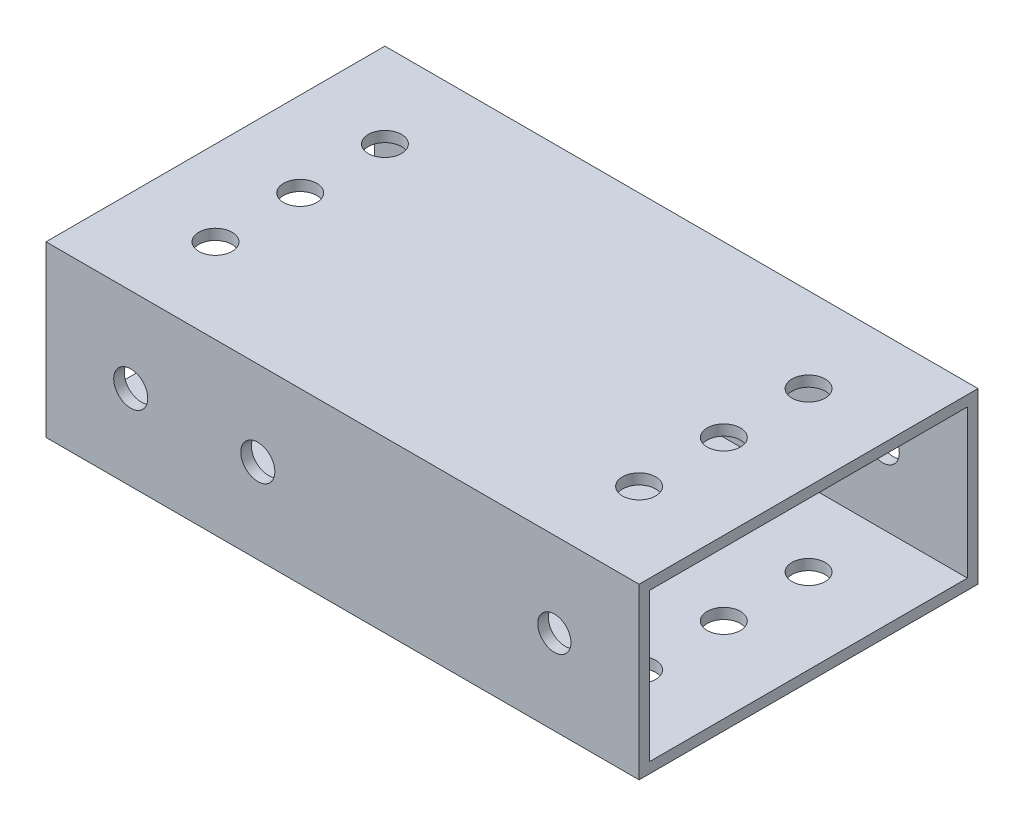
ISO-10303-21;
HEADER;
FILE_DESCRIPTION(('STEP AP214'),'2;1');
FILE_NAME('part.step','',(''),(''),'','','');
FILE_SCHEMA(('AUTOMOTIVE_DESIGN { 1 0 10303 214 1 1 1 1 }'));
ENDSEC;
DATA;
#1=APPLICATION_CONTEXT('core data for automotive mechanical design processes');
#2=APPLICATION_PROTOCOL_DEFINITION('international standard','automotive_design',2000,#1);
#3=PRODUCT_CONTEXT('',#1,'mechanical');
#4=PRODUCT('Part','Part','',(#3));
#5=PRODUCT_RELATED_PRODUCT_CATEGORY('part','',(#4));
#6=PRODUCT_DEFINITION_FORMATION('','',#4);
#7=PRODUCT_DEFINITION_CONTEXT('part definition',#1,'design');
#8=PRODUCT_DEFINITION('design','',#6,#7);
#9=PRODUCT_DEFINITION_SHAPE('','',#8);
#10=(LENGTH_UNIT() NAMED_UNIT(*) SI_UNIT(.MILLI.,.METRE.));
#11=(NAMED_UNIT(*) PLANE_ANGLE_UNIT() SI_UNIT($,.RADIAN.));
#12=(NAMED_UNIT(*) SI_UNIT($,.STERADIAN.) SOLID_ANGLE_UNIT());
#13=UNCERTAINTY_MEASURE_WITH_UNIT(LENGTH_MEASURE(1.E-05),#10,'distance_accuracy_value','');
#14=(GEOMETRIC_REPRESENTATION_CONTEXT(3) GLOBAL_UNCERTAINTY_ASSIGNED_CONTEXT((#13)) GLOBAL_UNIT_ASSIGNED_CONTEXT((#10,
#11,#12)) REPRESENTATION_CONTEXT('',''));
#15=CARTESIAN_POINT('',(0.,0.,0.));
#16=DIRECTION('',(0.,0.,1.));
#17=DIRECTION('',(1.,0.,0.));
#18=AXIS2_PLACEMENT_3D('',#15,#16,#17);
#19=CARTESIAN_POINT('',(44.45,0.,0.));
#20=DIRECTION('',(-1.,0.,0.));
#21=DIRECTION('',(0.,0.,1.));
#22=AXIS2_PLACEMENT_3D('',#19,#20,#21);
#23=PLANE('',#22);
#24=DIRECTION('',(0.,-1.,0.));
#25=VECTOR('',#24,1.);
#26=CARTESIAN_POINT('',(44.45,0.,0.));
#27=LINE('',#26,#25);
#28=CARTESIAN_POINT('',(44.45,25.4,0.));
#29=VERTEX_POINT('',#28);
#30=CARTESIAN_POINT('',(44.45,0.,0.));
#31=VERTEX_POINT('',#30);
#32=EDGE_CURVE('E135',#29,#31,#27,.T.);
#33=ORIENTED_EDGE('',*,*,#32,.T.);
#34=DIRECTION('',(0.,0.,-1.));
#35=VECTOR('',#34,1.);
#36=CARTESIAN_POINT('',(44.45,0.,0.));
#37=LINE('',#36,#35);
#38=CARTESIAN_POINT('',(44.45,0.,-50.8));
#39=VERTEX_POINT('',#38);
#40=EDGE_CURVE('E138',#31,#39,#37,.T.);
#41=ORIENTED_EDGE('',*,*,#40,.T.);
#42=DIRECTION('',(0.,1.,0.));
#43=VECTOR('',#42,1.);
#44=CARTESIAN_POINT('',(44.45,0.,-50.8));
#45=LINE('',#44,#43);
#46=CARTESIAN_POINT('',(44.45,25.4,-50.8));
#47=VERTEX_POINT('',#46);
#48=EDGE_CURVE('E141',#39,#47,#45,.T.);
#49=ORIENTED_EDGE('',*,*,#48,.T.);
#50=DIRECTION('',(0.,0.,1.));
#51=VECTOR('',#50,1.);
#52=CARTESIAN_POINT('',(44.45,25.4,0.));
#53=LINE('',#52,#51);
#54=EDGE_CURVE('E143',#47,#29,#53,.T.);
#55=ORIENTED_EDGE('',*,*,#54,.T.);
#56=EDGE_LOOP('',(#33,#41,#49,#55));
#57=FACE_BOUND('',#56,.T.);
#58=DIRECTION('',(0.,-1.,0.));
#59=VECTOR('',#58,1.);
#60=CARTESIAN_POINT('',(44.45,0.,-1.5875));
#61=LINE('',#60,#59);
#62=CARTESIAN_POINT('',(44.45,23.8125,-1.5875));
#63=VERTEX_POINT('',#62);
#64=CARTESIAN_POINT('',(44.45,1.5875,-1.5875));
#65=VERTEX_POINT('',#64);
#66=EDGE_CURVE('E123',#63,#65,#61,.T.);
#67=ORIENTED_EDGE('',*,*,#66,.F.);
#68=DIRECTION('',(0.,0.,1.));
#69=VECTOR('',#68,1.);
#70=CARTESIAN_POINT('',(44.45,23.8125,0.));
#71=LINE('',#70,#69);
#72=CARTESIAN_POINT('',(44.45,23.8125,-49.2125));
#73=VERTEX_POINT('',#72);
#74=EDGE_CURVE('E107',#73,#63,#71,.T.);
#75=ORIENTED_EDGE('',*,*,#74,.F.);
#76=DIRECTION('',(0.,1.,0.));
#77=VECTOR('',#76,1.);
#78=CARTESIAN_POINT('',(44.45,0.,-49.2125));
#79=LINE('',#78,#77);
#80=CARTESIAN_POINT('',(44.45,1.5875,-49.2125));
#81=VERTEX_POINT('',#80);
#82=EDGE_CURVE('E132',#81,#73,#79,.T.);
#83=ORIENTED_EDGE('',*,*,#82,.F.);
#84=DIRECTION('',(0.,0.,-1.));
#85=VECTOR('',#84,1.);
#86=CARTESIAN_POINT('',(44.45,1.5875,0.));
#87=LINE('',#86,#85);
#88=EDGE_CURVE('E125',#65,#81,#87,.T.);
#89=ORIENTED_EDGE('',*,*,#88,.F.);
#90=EDGE_LOOP('',(#67,#75,#83,#89));
#91=FACE_BOUND('',#90,.T.);
#92=ADVANCED_FACE('F35',(#57,#91),#23,.F.);
#93=CARTESIAN_POINT('',(-44.45,0.,0.));
#94=DIRECTION('',(-1.,0.,0.));
#95=DIRECTION('',(0.,0.,1.));
#96=AXIS2_PLACEMENT_3D('',#93,#94,#95);
#97=PLANE('',#96);
#98=DIRECTION('',(0.,-1.,0.));
#99=VECTOR('',#98,1.);
#100=CARTESIAN_POINT('',(-44.45,0.,0.));
#101=LINE('',#100,#99);
#102=CARTESIAN_POINT('',(-44.45,25.4,0.));
#103=VERTEX_POINT('',#102);
#104=CARTESIAN_POINT('',(-44.45,0.,0.));
#105=VERTEX_POINT('',#104);
#106=EDGE_CURVE('E146',#103,#105,#101,.T.);
#107=ORIENTED_EDGE('',*,*,#106,.F.);
#108=DIRECTION('',(0.,0.,1.));
#109=VECTOR('',#108,1.);
#110=CARTESIAN_POINT('',(-44.45,25.4,0.));
#111=LINE('',#110,#109);
#112=CARTESIAN_POINT('',(-44.45,25.4,-50.8));
#113=VERTEX_POINT('',#112);
#114=EDGE_CURVE('E139',#113,#103,#111,.T.);
#115=ORIENTED_EDGE('',*,*,#114,.F.);
#116=DIRECTION('',(0.,1.,0.));
#117=VECTOR('',#116,1.);
#118=CARTESIAN_POINT('',(-44.45,0.,-50.8));
#119=LINE('',#118,#117);
#120=CARTESIAN_POINT('',(-44.45,0.,-50.8));
#121=VERTEX_POINT('',#120);
#122=EDGE_CURVE('E151',#121,#113,#119,.T.);
#123=ORIENTED_EDGE('',*,*,#122,.F.);
#124=DIRECTION('',(0.,0.,-1.));
#125=VECTOR('',#124,1.);
#126=CARTESIAN_POINT('',(-44.45,0.,0.));
#127=LINE('',#126,#125);
#128=EDGE_CURVE('E149',#105,#121,#127,.T.);
#129=ORIENTED_EDGE('',*,*,#128,.F.);
#130=EDGE_LOOP('',(#107,#115,#123,#129));
#131=FACE_BOUND('',#130,.T.);
#132=DIRECTION('',(0.,0.,1.));
#133=VECTOR('',#132,1.);
#134=CARTESIAN_POINT('',(-44.45,23.8125,0.));
#135=LINE('',#134,#133);
#136=CARTESIAN_POINT('',(-44.45,23.8125,-49.2125));
#137=VERTEX_POINT('',#136);
#138=CARTESIAN_POINT('',(-44.45,23.8125,-1.5875));
#139=VERTEX_POINT('',#138);
#140=EDGE_CURVE('E105',#137,#139,#135,.T.);
#141=ORIENTED_EDGE('',*,*,#140,.T.);
#142=DIRECTION('',(0.,-1.,0.));
#143=VECTOR('',#142,1.);
#144=CARTESIAN_POINT('',(-44.45,0.,-1.5875));
#145=LINE('',#144,#143);
#146=CARTESIAN_POINT('',(-44.45,1.5875,-1.5875));
#147=VERTEX_POINT('',#146);
#148=EDGE_CURVE('E113',#139,#147,#145,.T.);
#149=ORIENTED_EDGE('',*,*,#148,.T.);
#150=DIRECTION('',(0.,0.,-1.));
#151=VECTOR('',#150,1.);
#152=CARTESIAN_POINT('',(-44.45,1.5875,0.));
#153=LINE('',#152,#151);
#154=CARTESIAN_POINT('',(-44.45,1.5875,-49.2125));
#155=VERTEX_POINT('',#154);
#156=EDGE_CURVE('E119',#147,#155,#153,.T.);
#157=ORIENTED_EDGE('',*,*,#156,.T.);
#158=DIRECTION('',(0.,1.,0.));
#159=VECTOR('',#158,1.);
#160=CARTESIAN_POINT('',(-44.45,0.,-49.2125));
#161=LINE('',#160,#159);
#162=EDGE_CURVE('E59',#155,#137,#161,.T.);
#163=ORIENTED_EDGE('',*,*,#162,.T.);
#164=EDGE_LOOP('',(#141,#149,#157,#163));
#165=FACE_BOUND('',#164,.T.);
#166=ADVANCED_FACE('F122',(#131,#165),#97,.T.);
#167=CARTESIAN_POINT('',(44.45,0.,0.));
#168=DIRECTION('',(0.,0.,-1.));
#169=DIRECTION('',(-1.,0.,0.));
#170=AXIS2_PLACEMENT_3D('',#167,#168,#169);
#171=PLANE('',#170);
#172=CARTESIAN_POINT('',(-31.75,12.7,0.));
#173=DIRECTION('',(0.,0.,1.));
#174=DIRECTION('',(1.,0.,0.));
#175=AXIS2_PLACEMENT_3D('',#172,#173,#174);
#176=CIRCLE('',#175,2.5527);
#177=CARTESIAN_POINT('',(-29.1973,12.7,0.));
#178=VERTEX_POINT('',#177);
#179=EDGE_CURVE('E561',#178,#178,#176,.T.);
#180=ORIENTED_EDGE('',*,*,#179,.F.);
#181=EDGE_LOOP('',(#180));
#182=FACE_BOUND('',#181,.T.);
#183=CARTESIAN_POINT('',(-12.7,12.7,0.));
#184=DIRECTION('',(0.,0.,1.));
#185=DIRECTION('',(1.,0.,0.));
#186=AXIS2_PLACEMENT_3D('',#183,#184,#185);
#187=CIRCLE('',#186,2.5527);
#188=CARTESIAN_POINT('',(-10.1473,12.7,0.));
#189=VERTEX_POINT('',#188);
#190=EDGE_CURVE('E562',#189,#189,#187,.T.);
#191=ORIENTED_EDGE('',*,*,#190,.F.);
#192=EDGE_LOOP('',(#191));
#193=FACE_BOUND('',#192,.T.);
#194=CARTESIAN_POINT('',(31.75,12.7,0.));
#195=DIRECTION('',(0.,0.,-1.));
#196=DIRECTION('',(-1.,0.,0.));
#197=AXIS2_PLACEMENT_3D('',#194,#195,#196);
#198=CIRCLE('',#197,2.4892);
#199=CARTESIAN_POINT('',(29.2608,12.7,0.));
#200=VERTEX_POINT('',#199);
#201=EDGE_CURVE('E200',#200,#200,#198,.T.);
#202=ORIENTED_EDGE('',*,*,#201,.T.);
#203=EDGE_LOOP('',(#202));
#204=FACE_BOUND('',#203,.T.);
#205=ORIENTED_EDGE('',*,*,#106,.T.);
#206=DIRECTION('',(-1.,0.,0.));
#207=VECTOR('',#206,1.);
#208=CARTESIAN_POINT('',(44.45,0.,0.));
#209=LINE('',#208,#207);
#210=EDGE_CURVE('E11',#31,#105,#209,.T.);
#211=ORIENTED_EDGE('',*,*,#210,.F.);
#212=ORIENTED_EDGE('',*,*,#32,.F.);
#213=DIRECTION('',(-1.,0.,0.));
#214=VECTOR('',#213,1.);
#215=CARTESIAN_POINT('',(44.45,25.4,0.));
#216=LINE('',#215,#214);
#217=EDGE_CURVE('E145',#29,#103,#216,.T.);
#218=ORIENTED_EDGE('',*,*,#217,.T.);
#219=EDGE_LOOP('',(#205,#211,#212,#218));
#220=FACE_BOUND('',#219,.T.);
#221=ADVANCED_FACE('F37',(#182,#193,#204,#220),#171,.F.);
#222=CARTESIAN_POINT('',(44.45,0.,0.));
#223=DIRECTION('',(0.,1.,0.));
#224=DIRECTION('',(0.,0.,1.));
#225=AXIS2_PLACEMENT_3D('',#222,#223,#224);
#226=PLANE('',#225);
#227=CARTESIAN_POINT('',(31.75,0.,-38.1));
#228=DIRECTION('',(0.,-1.,0.));
#229=DIRECTION('',(0.,0.,1.));
#230=AXIS2_PLACEMENT_3D('',#227,#228,#229);
#231=CIRCLE('',#230,2.4892);
#232=CARTESIAN_POINT('',(31.75,0.,-35.6108));
#233=VERTEX_POINT('',#232);
#234=EDGE_CURVE('E217',#233,#233,#231,.T.);
#235=ORIENTED_EDGE('',*,*,#234,.F.);
#236=EDGE_LOOP('',(#235));
#237=FACE_BOUND('',#236,.T.);
#238=CARTESIAN_POINT('',(31.75,0.,-12.7));
#239=DIRECTION('',(0.,-1.,0.));
#240=DIRECTION('',(0.,0.,1.));
#241=AXIS2_PLACEMENT_3D('',#238,#239,#240);
#242=CIRCLE('',#241,2.4892);
#243=CARTESIAN_POINT('',(31.75,0.,-10.2108));
#244=VERTEX_POINT('',#243);
#245=EDGE_CURVE('E210',#244,#244,#242,.T.);
#246=ORIENTED_EDGE('',*,*,#245,.F.);
#247=EDGE_LOOP('',(#246));
#248=FACE_BOUND('',#247,.T.);
#249=CARTESIAN_POINT('',(31.75,0.,-25.4));
#250=DIRECTION('',(0.,-1.,0.));
#251=DIRECTION('',(0.,0.,1.));
#252=AXIS2_PLACEMENT_3D('',#249,#250,#251);
#253=CIRCLE('',#252,2.4892);
#254=CARTESIAN_POINT('',(31.75,0.,-22.9108));
#255=VERTEX_POINT('',#254);
#256=EDGE_CURVE('E182',#255,#255,#253,.T.);
#257=ORIENTED_EDGE('',*,*,#256,.F.);
#258=EDGE_LOOP('',(#257));
#259=FACE_BOUND('',#258,.T.);
#260=CARTESIAN_POINT('',(-31.75,0.,-38.1));
#261=DIRECTION('',(0.,1.,0.));
#262=DIRECTION('',(0.,0.,1.));
#263=AXIS2_PLACEMENT_3D('',#260,#261,#262);
#264=CIRCLE('',#263,2.4892);
#265=CARTESIAN_POINT('',(-31.75,0.,-35.6108));
#266=VERTEX_POINT('',#265);
#267=EDGE_CURVE('E241',#266,#266,#264,.T.);
#268=ORIENTED_EDGE('',*,*,#267,.T.);
#269=EDGE_LOOP('',(#268));
#270=FACE_BOUND('',#269,.T.);
#271=CARTESIAN_POINT('',(-31.75,0.,-12.7));
#272=DIRECTION('',(0.,1.,0.));
#273=DIRECTION('',(0.,0.,1.));
#274=AXIS2_PLACEMENT_3D('',#271,#272,#273);
#275=CIRCLE('',#274,2.4892);
#276=CARTESIAN_POINT('',(-31.75,0.,-10.2108));
#277=VERTEX_POINT('',#276);
#278=EDGE_CURVE('E234',#277,#277,#275,.T.);
#279=ORIENTED_EDGE('',*,*,#278,.T.);
#280=EDGE_LOOP('',(#279));
#281=FACE_BOUND('',#280,.T.);
#282=CARTESIAN_POINT('',(-31.75,0.,-25.4));
#283=DIRECTION('',(0.,1.,0.));
#284=DIRECTION('',(0.,0.,1.));
#285=AXIS2_PLACEMENT_3D('',#282,#283,#284);
#286=CIRCLE('',#285,2.4892);
#287=CARTESIAN_POINT('',(-31.75,0.,-22.9108));
#288=VERTEX_POINT('',#287);
#289=EDGE_CURVE('E165',#288,#288,#286,.T.);
#290=ORIENTED_EDGE('',*,*,#289,.T.);
#291=EDGE_LOOP('',(#290));
#292=FACE_BOUND('',#291,.T.);
#293=ORIENTED_EDGE('',*,*,#128,.T.);
#294=DIRECTION('',(-1.,0.,0.));
#295=VECTOR('',#294,1.);
#296=CARTESIAN_POINT('',(44.45,0.,-50.8));
#297=LINE('',#296,#295);
#298=EDGE_CURVE('E44',#39,#121,#297,.T.);
#299=ORIENTED_EDGE('',*,*,#298,.F.);
#300=ORIENTED_EDGE('',*,*,#40,.F.);
#301=ORIENTED_EDGE('',*,*,#210,.T.);
#302=EDGE_LOOP('',(#293,#299,#300,#301));
#303=FACE_BOUND('',#302,.T.);
#304=ADVANCED_FACE('F292',(#237,#248,#259,#270,#281,#292,#303),#226,.F.);
#305=CARTESIAN_POINT('',(44.45,0.,-50.8));
#306=DIRECTION('',(0.,0.,1.));
#307=DIRECTION('',(1.,0.,0.));
#308=AXIS2_PLACEMENT_3D('',#305,#306,#307);
#309=PLANE('',#308);
#310=CARTESIAN_POINT('',(-12.7,12.7,-50.8));
#311=DIRECTION('',(0.,0.,1.));
#312=DIRECTION('',(1.,0.,0.));
#313=AXIS2_PLACEMENT_3D('',#310,#311,#312);
#314=CIRCLE('',#313,2.5527);
#315=CARTESIAN_POINT('',(-10.1473,12.7,-50.8));
#316=VERTEX_POINT('',#315);
#317=EDGE_CURVE('E565',#316,#316,#314,.T.);
#318=ORIENTED_EDGE('',*,*,#317,.T.);
#319=EDGE_LOOP('',(#318));
#320=FACE_BOUND('',#319,.T.);
#321=CARTESIAN_POINT('',(31.75,12.7,-50.8));
#322=DIRECTION('',(0.,0.,-1.));
#323=DIRECTION('',(-1.,0.,0.));
#324=AXIS2_PLACEMENT_3D('',#321,#322,#323);
#325=CIRCLE('',#324,2.4892);
#326=CARTESIAN_POINT('',(29.2608,12.7,-50.8));
#327=VERTEX_POINT('',#326);
#328=EDGE_CURVE('E193',#327,#327,#325,.T.);
#329=ORIENTED_EDGE('',*,*,#328,.F.);
#330=EDGE_LOOP('',(#329));
#331=FACE_BOUND('',#330,.T.);
#332=CARTESIAN_POINT('',(-31.75,12.7,-50.8));
#333=DIRECTION('',(0.,0.,1.));
#334=DIRECTION('',(1.,0.,0.));
#335=AXIS2_PLACEMENT_3D('',#332,#333,#334);
#336=CIRCLE('',#335,2.4892);
#337=CARTESIAN_POINT('',(-29.2608,12.7,-50.8));
#338=VERTEX_POINT('',#337);
#339=EDGE_CURVE('E177',#338,#338,#336,.T.);
#340=ORIENTED_EDGE('',*,*,#339,.T.);
#341=EDGE_LOOP('',(#340));
#342=FACE_BOUND('',#341,.T.);
#343=ORIENTED_EDGE('',*,*,#122,.T.);
#344=DIRECTION('',(-1.,0.,0.));
#345=VECTOR('',#344,1.);
#346=CARTESIAN_POINT('',(44.45,25.4,-50.8));
#347=LINE('',#346,#345);
#348=EDGE_CURVE('E156',#47,#113,#347,.T.);
#349=ORIENTED_EDGE('',*,*,#348,.F.);
#350=ORIENTED_EDGE('',*,*,#48,.F.);
#351=ORIENTED_EDGE('',*,*,#298,.T.);
#352=EDGE_LOOP('',(#343,#349,#350,#351));
#353=FACE_BOUND('',#352,.T.);
#354=ADVANCED_FACE('F289',(#320,#331,#342,#353),#309,.F.);
#355=CARTESIAN_POINT('',(44.45,25.4,0.));
#356=DIRECTION('',(0.,-1.,0.));
#357=DIRECTION('',(0.,0.,-1.));
#358=AXIS2_PLACEMENT_3D('',#355,#356,#357);
#359=PLANE('',#358);
#360=CARTESIAN_POINT('',(31.75,25.4,-38.1));
#361=DIRECTION('',(0.,-1.,0.));
#362=DIRECTION('',(0.,0.,1.));
#363=AXIS2_PLACEMENT_3D('',#360,#361,#362);
#364=CIRCLE('',#363,2.4892);
#365=CARTESIAN_POINT('',(31.75,25.4,-35.6108));
#366=VERTEX_POINT('',#365);
#367=EDGE_CURVE('E197',#366,#366,#364,.T.);
#368=ORIENTED_EDGE('',*,*,#367,.T.);
#369=EDGE_LOOP('',(#368));
#370=FACE_BOUND('',#369,.T.);
#371=CARTESIAN_POINT('',(31.75,25.4,-12.7));
#372=DIRECTION('',(0.,-1.,0.));
#373=DIRECTION('',(0.,0.,1.));
#374=AXIS2_PLACEMENT_3D('',#371,#372,#373);
#375=CIRCLE('',#374,2.4892);
#376=CARTESIAN_POINT('',(31.75,25.4,-10.2108));
#377=VERTEX_POINT('',#376);
#378=EDGE_CURVE('E214',#377,#377,#375,.T.);
#379=ORIENTED_EDGE('',*,*,#378,.T.);
#380=EDGE_LOOP('',(#379));
#381=FACE_BOUND('',#380,.T.);
#382=CARTESIAN_POINT('',(31.75,25.4,-25.4));
#383=DIRECTION('',(0.,-1.,0.));
#384=DIRECTION('',(0.,0.,1.));
#385=AXIS2_PLACEMENT_3D('',#382,#383,#384);
#386=CIRCLE('',#385,2.4892);
#387=CARTESIAN_POINT('',(31.75,25.4,-22.9108));
#388=VERTEX_POINT('',#387);
#389=EDGE_CURVE('E213',#388,#388,#386,.T.);
#390=ORIENTED_EDGE('',*,*,#389,.T.);
#391=EDGE_LOOP('',(#390));
#392=FACE_BOUND('',#391,.T.);
#393=CARTESIAN_POINT('',(-31.75,25.4,-38.1));
#394=DIRECTION('',(0.,1.,0.));
#395=DIRECTION('',(0.,0.,1.));
#396=AXIS2_PLACEMENT_3D('',#393,#394,#395);
#397=CIRCLE('',#396,2.4892);
#398=CARTESIAN_POINT('',(-31.75,25.4,-35.6108));
#399=VERTEX_POINT('',#398);
#400=EDGE_CURVE('E176',#399,#399,#397,.T.);
#401=ORIENTED_EDGE('',*,*,#400,.F.);
#402=EDGE_LOOP('',(#401));
#403=FACE_BOUND('',#402,.T.);
#404=CARTESIAN_POINT('',(-31.75,25.4,-12.7));
#405=DIRECTION('',(0.,1.,0.));
#406=DIRECTION('',(0.,0.,1.));
#407=AXIS2_PLACEMENT_3D('',#404,#405,#406);
#408=CIRCLE('',#407,2.4892);
#409=CARTESIAN_POINT('',(-31.75,25.4,-10.2108));
#410=VERTEX_POINT('',#409);
#411=EDGE_CURVE('E238',#410,#410,#408,.T.);
#412=ORIENTED_EDGE('',*,*,#411,.F.);
#413=EDGE_LOOP('',(#412));
#414=FACE_BOUND('',#413,.T.);
#415=CARTESIAN_POINT('',(-31.75,25.4,-25.4));
#416=DIRECTION('',(0.,1.,0.));
#417=DIRECTION('',(0.,0.,1.));
#418=AXIS2_PLACEMENT_3D('',#415,#416,#417);
#419=CIRCLE('',#418,2.4892);
#420=CARTESIAN_POINT('',(-31.75,25.4,-22.9108));
#421=VERTEX_POINT('',#420);
#422=EDGE_CURVE('E237',#421,#421,#419,.T.);
#423=ORIENTED_EDGE('',*,*,#422,.F.);
#424=EDGE_LOOP('',(#423));
#425=FACE_BOUND('',#424,.T.);
#426=ORIENTED_EDGE('',*,*,#114,.T.);
#427=ORIENTED_EDGE('',*,*,#217,.F.);
#428=ORIENTED_EDGE('',*,*,#54,.F.);
#429=ORIENTED_EDGE('',*,*,#348,.T.);
#430=EDGE_LOOP('',(#426,#427,#428,#429));
#431=FACE_BOUND('',#430,.T.);
#432=ADVANCED_FACE('F273',(#370,#381,#392,#403,#414,#425,#431),#359,.F.);
#433=CARTESIAN_POINT('',(44.45,0.,-1.5875));
#434=DIRECTION('',(0.,0.,-1.));
#435=DIRECTION('',(-1.,0.,0.));
#436=AXIS2_PLACEMENT_3D('',#433,#434,#435);
#437=PLANE('',#436);
#438=CARTESIAN_POINT('',(-31.75,12.7,-1.5875));
#439=DIRECTION('',(0.,0.,-1.));
#440=DIRECTION('',(-1.,0.,0.));
#441=AXIS2_PLACEMENT_3D('',#438,#439,#440);
#442=CIRCLE('',#441,2.5527);
#443=CARTESIAN_POINT('',(-34.3027,12.7,-1.5875));
#444=VERTEX_POINT('',#443);
#445=EDGE_CURVE('E558',#444,#444,#442,.F.);
#446=ORIENTED_EDGE('',*,*,#445,.T.);
#447=EDGE_LOOP('',(#446));
#448=FACE_BOUND('',#447,.T.);
#449=CARTESIAN_POINT('',(-12.7,12.7,-1.5875));
#450=DIRECTION('',(0.,0.,-1.));
#451=DIRECTION('',(-1.,0.,0.));
#452=AXIS2_PLACEMENT_3D('',#449,#450,#451);
#453=CIRCLE('',#452,2.5527);
#454=CARTESIAN_POINT('',(-15.2527,12.7,-1.5875));
#455=VERTEX_POINT('',#454);
#456=EDGE_CURVE('E205',#455,#455,#453,.T.);
#457=ORIENTED_EDGE('',*,*,#456,.F.);
#458=EDGE_LOOP('',(#457));
#459=FACE_BOUND('',#458,.T.);
#460=CARTESIAN_POINT('',(31.75,12.7,-1.5875));
#461=DIRECTION('',(0.,0.,-1.));
#462=DIRECTION('',(-1.,0.,0.));
#463=AXIS2_PLACEMENT_3D('',#460,#461,#462);
#464=CIRCLE('',#463,2.4892);
#465=CARTESIAN_POINT('',(29.2608,12.7,-1.5875));
#466=VERTEX_POINT('',#465);
#467=EDGE_CURVE('E192',#466,#466,#464,.F.);
#468=ORIENTED_EDGE('',*,*,#467,.T.);
#469=EDGE_LOOP('',(#468));
#470=FACE_BOUND('',#469,.T.);
#471=ORIENTED_EDGE('',*,*,#148,.F.);
#472=DIRECTION('',(-1.,0.,0.));
#473=VECTOR('',#472,1.);
#474=CARTESIAN_POINT('',(44.45,23.8125,-1.5875));
#475=LINE('',#474,#473);
#476=EDGE_CURVE('E101',#63,#139,#475,.T.);
#477=ORIENTED_EDGE('',*,*,#476,.F.);
#478=ORIENTED_EDGE('',*,*,#66,.T.);
#479=DIRECTION('',(-1.,0.,0.));
#480=VECTOR('',#479,1.);
#481=CARTESIAN_POINT('',(44.45,1.5875,-1.5875));
#482=LINE('',#481,#480);
#483=EDGE_CURVE('E116',#65,#147,#482,.T.);
#484=ORIENTED_EDGE('',*,*,#483,.T.);
#485=EDGE_LOOP('',(#471,#477,#478,#484));
#486=FACE_BOUND('',#485,.T.);
#487=ADVANCED_FACE('F114',(#448,#459,#470,#486),#437,.T.);
#488=CARTESIAN_POINT('',(44.45,1.5875,0.));
#489=DIRECTION('',(0.,1.,0.));
#490=DIRECTION('',(0.,0.,1.));
#491=AXIS2_PLACEMENT_3D('',#488,#489,#490);
#492=PLANE('',#491);
#493=CARTESIAN_POINT('',(31.75,1.5875,-38.1));
#494=DIRECTION('',(0.,1.,0.));
#495=DIRECTION('',(0.,0.,1.));
#496=AXIS2_PLACEMENT_3D('',#493,#494,#495);
#497=CIRCLE('',#496,2.4892);
#498=CARTESIAN_POINT('',(31.75,1.5875,-35.6108));
#499=VERTEX_POINT('',#498);
#500=EDGE_CURVE('E189',#499,#499,#497,.F.);
#501=ORIENTED_EDGE('',*,*,#500,.T.);
#502=EDGE_LOOP('',(#501));
#503=FACE_BOUND('',#502,.T.);
#504=CARTESIAN_POINT('',(31.75,1.5875,-12.7));
#505=DIRECTION('',(0.,1.,0.));
#506=DIRECTION('',(0.,0.,1.));
#507=AXIS2_PLACEMENT_3D('',#504,#505,#506);
#508=CIRCLE('',#507,2.4892);
#509=CARTESIAN_POINT('',(31.75,1.5875,-10.2108));
#510=VERTEX_POINT('',#509);
#511=EDGE_CURVE('E186',#510,#510,#508,.F.);
#512=ORIENTED_EDGE('',*,*,#511,.T.);
#513=EDGE_LOOP('',(#512));
#514=FACE_BOUND('',#513,.T.);
#515=CARTESIAN_POINT('',(31.75,1.5875,-25.4));
#516=DIRECTION('',(0.,1.,0.));
#517=DIRECTION('',(0.,0.,1.));
#518=AXIS2_PLACEMENT_3D('',#515,#516,#517);
#519=CIRCLE('',#518,2.4892);
#520=CARTESIAN_POINT('',(31.75,1.5875,-22.9108));
#521=VERTEX_POINT('',#520);
#522=EDGE_CURVE('E181',#521,#521,#519,.F.);
#523=ORIENTED_EDGE('',*,*,#522,.T.);
#524=EDGE_LOOP('',(#523));
#525=FACE_BOUND('',#524,.T.);
#526=CARTESIAN_POINT('',(-31.75,1.5875,-38.1));
#527=DIRECTION('',(0.,1.,0.));
#528=DIRECTION('',(0.,0.,1.));
#529=AXIS2_PLACEMENT_3D('',#526,#527,#528);
#530=CIRCLE('',#529,2.4892);
#531=CARTESIAN_POINT('',(-31.75,1.5875,-35.6108));
#532=VERTEX_POINT('',#531);
#533=EDGE_CURVE('E120',#532,#532,#530,.T.);
#534=ORIENTED_EDGE('',*,*,#533,.F.);
#535=EDGE_LOOP('',(#534));
#536=FACE_BOUND('',#535,.T.);
#537=CARTESIAN_POINT('',(-31.75,1.5875,-12.7));
#538=DIRECTION('',(0.,1.,0.));
#539=DIRECTION('',(0.,0.,1.));
#540=AXIS2_PLACEMENT_3D('',#537,#538,#539);
#541=CIRCLE('',#540,2.4892);
#542=CARTESIAN_POINT('',(-31.75,1.5875,-10.2108));
#543=VERTEX_POINT('',#542);
#544=EDGE_CURVE('E169',#543,#543,#541,.T.);
#545=ORIENTED_EDGE('',*,*,#544,.F.);
#546=EDGE_LOOP('',(#545));
#547=FACE_BOUND('',#546,.T.);
#548=CARTESIAN_POINT('',(-31.75,1.5875,-25.4));
#549=DIRECTION('',(0.,1.,0.));
#550=DIRECTION('',(0.,0.,1.));
#551=AXIS2_PLACEMENT_3D('',#548,#549,#550);
#552=CIRCLE('',#551,2.4892);
#553=CARTESIAN_POINT('',(-31.75,1.5875,-22.9108));
#554=VERTEX_POINT('',#553);
#555=EDGE_CURVE('E164',#554,#554,#552,.T.);
#556=ORIENTED_EDGE('',*,*,#555,.F.);
#557=EDGE_LOOP('',(#556));
#558=FACE_BOUND('',#557,.T.);
#559=ORIENTED_EDGE('',*,*,#156,.F.);
#560=ORIENTED_EDGE('',*,*,#483,.F.);
#561=ORIENTED_EDGE('',*,*,#88,.T.);
#562=DIRECTION('',(-1.,0.,0.));
#563=VECTOR('',#562,1.);
#564=CARTESIAN_POINT('',(44.45,1.5875,-49.2125));
#565=LINE('',#564,#563);
#566=EDGE_CURVE('E256',#81,#155,#565,.T.);
#567=ORIENTED_EDGE('',*,*,#566,.T.);
#568=EDGE_LOOP('',(#559,#560,#561,#567));
#569=FACE_BOUND('',#568,.T.);
#570=ADVANCED_FACE('F263',(#503,#514,#525,#536,#547,#558,#569),#492,.T.);
#571=CARTESIAN_POINT('',(44.45,0.,-49.2125));
#572=DIRECTION('',(0.,0.,1.));
#573=DIRECTION('',(1.,0.,0.));
#574=AXIS2_PLACEMENT_3D('',#571,#572,#573);
#575=PLANE('',#574);
#576=CARTESIAN_POINT('',(-12.7,12.7,-49.2125));
#577=DIRECTION('',(0.,0.,1.));
#578=DIRECTION('',(1.,0.,0.));
#579=AXIS2_PLACEMENT_3D('',#576,#577,#578);
#580=CIRCLE('',#579,2.5527);
#581=CARTESIAN_POINT('',(-10.1473,12.7,-49.2125));
#582=VERTEX_POINT('',#581);
#583=EDGE_CURVE('E39',#582,#582,#580,.T.);
#584=ORIENTED_EDGE('',*,*,#583,.F.);
#585=EDGE_LOOP('',(#584));
#586=FACE_BOUND('',#585,.T.);
#587=CARTESIAN_POINT('',(31.75,12.7,-49.2125));
#588=DIRECTION('',(0.,0.,1.));
#589=DIRECTION('',(1.,0.,0.));
#590=AXIS2_PLACEMENT_3D('',#587,#588,#589);
#591=CIRCLE('',#590,2.4892);
#592=CARTESIAN_POINT('',(34.2392,12.7,-49.2125));
#593=VERTEX_POINT('',#592);
#594=EDGE_CURVE('E190',#593,#593,#591,.F.);
#595=ORIENTED_EDGE('',*,*,#594,.T.);
#596=EDGE_LOOP('',(#595));
#597=FACE_BOUND('',#596,.T.);
#598=CARTESIAN_POINT('',(-31.75,12.7,-49.2125));
#599=DIRECTION('',(0.,0.,1.));
#600=DIRECTION('',(1.,0.,0.));
#601=AXIS2_PLACEMENT_3D('',#598,#599,#600);
#602=CIRCLE('',#601,2.4892);
#603=CARTESIAN_POINT('',(-29.2608,12.7,-49.2125));
#604=VERTEX_POINT('',#603);
#605=EDGE_CURVE('E173',#604,#604,#602,.T.);
#606=ORIENTED_EDGE('',*,*,#605,.F.);
#607=EDGE_LOOP('',(#606));
#608=FACE_BOUND('',#607,.T.);
#609=ORIENTED_EDGE('',*,*,#162,.F.);
#610=ORIENTED_EDGE('',*,*,#566,.F.);
#611=ORIENTED_EDGE('',*,*,#82,.T.);
#612=DIRECTION('',(-1.,0.,0.));
#613=VECTOR('',#612,1.);
#614=CARTESIAN_POINT('',(44.45,23.8125,-49.2125));
#615=LINE('',#614,#613);
#616=EDGE_CURVE('E52',#73,#137,#615,.T.);
#617=ORIENTED_EDGE('',*,*,#616,.T.);
#618=EDGE_LOOP('',(#609,#610,#611,#617));
#619=FACE_BOUND('',#618,.T.);
#620=ADVANCED_FACE('F258',(#586,#597,#608,#619),#575,.T.);
#621=CARTESIAN_POINT('',(44.45,23.8125,0.));
#622=DIRECTION('',(0.,-1.,0.));
#623=DIRECTION('',(0.,0.,-1.));
#624=AXIS2_PLACEMENT_3D('',#621,#622,#623);
#625=PLANE('',#624);
#626=CARTESIAN_POINT('',(31.75,23.8125,-38.1));
#627=DIRECTION('',(0.,-1.,0.));
#628=DIRECTION('',(0.,0.,-1.));
#629=AXIS2_PLACEMENT_3D('',#626,#627,#628);
#630=CIRCLE('',#629,2.4892);
#631=CARTESIAN_POINT('',(31.75,23.8125,-40.5892));
#632=VERTEX_POINT('',#631);
#633=EDGE_CURVE('E187',#632,#632,#630,.F.);
#634=ORIENTED_EDGE('',*,*,#633,.T.);
#635=EDGE_LOOP('',(#634));
#636=FACE_BOUND('',#635,.T.);
#637=CARTESIAN_POINT('',(31.75,23.8125,-12.7));
#638=DIRECTION('',(0.,-1.,0.));
#639=DIRECTION('',(0.,0.,-1.));
#640=AXIS2_PLACEMENT_3D('',#637,#638,#639);
#641=CIRCLE('',#640,2.4892);
#642=CARTESIAN_POINT('',(31.75,23.8125,-15.1892));
#643=VERTEX_POINT('',#642);
#644=EDGE_CURVE('E183',#643,#643,#641,.F.);
#645=ORIENTED_EDGE('',*,*,#644,.T.);
#646=EDGE_LOOP('',(#645));
#647=FACE_BOUND('',#646,.T.);
#648=CARTESIAN_POINT('',(31.75,23.8125,-25.4));
#649=DIRECTION('',(0.,-1.,0.));
#650=DIRECTION('',(0.,0.,-1.));
#651=AXIS2_PLACEMENT_3D('',#648,#649,#650);
#652=CIRCLE('',#651,2.4892);
#653=CARTESIAN_POINT('',(31.75,23.8125,-27.8892));
#654=VERTEX_POINT('',#653);
#655=EDGE_CURVE('E178',#654,#654,#652,.F.);
#656=ORIENTED_EDGE('',*,*,#655,.T.);
#657=EDGE_LOOP('',(#656));
#658=FACE_BOUND('',#657,.T.);
#659=CARTESIAN_POINT('',(-31.75,23.8125,-38.1));
#660=DIRECTION('',(0.,-1.,0.));
#661=DIRECTION('',(0.,0.,-1.));
#662=AXIS2_PLACEMENT_3D('',#659,#660,#661);
#663=CIRCLE('',#662,2.4892);
#664=CARTESIAN_POINT('',(-31.75,23.8125,-40.5892));
#665=VERTEX_POINT('',#664);
#666=EDGE_CURVE('E170',#665,#665,#663,.T.);
#667=ORIENTED_EDGE('',*,*,#666,.F.);
#668=EDGE_LOOP('',(#667));
#669=FACE_BOUND('',#668,.T.);
#670=CARTESIAN_POINT('',(-31.75,23.8125,-12.7));
#671=DIRECTION('',(0.,-1.,0.));
#672=DIRECTION('',(0.,0.,-1.));
#673=AXIS2_PLACEMENT_3D('',#670,#671,#672);
#674=CIRCLE('',#673,2.4892);
#675=CARTESIAN_POINT('',(-31.75,23.8125,-15.1892));
#676=VERTEX_POINT('',#675);
#677=EDGE_CURVE('E166',#676,#676,#674,.T.);
#678=ORIENTED_EDGE('',*,*,#677,.F.);
#679=EDGE_LOOP('',(#678));
#680=FACE_BOUND('',#679,.T.);
#681=CARTESIAN_POINT('',(-31.75,23.8125,-25.4));
#682=DIRECTION('',(0.,-1.,0.));
#683=DIRECTION('',(0.,0.,-1.));
#684=AXIS2_PLACEMENT_3D('',#681,#682,#683);
#685=CIRCLE('',#684,2.4892);
#686=CARTESIAN_POINT('',(-31.75,23.8125,-27.8892));
#687=VERTEX_POINT('',#686);
#688=EDGE_CURVE('E161',#687,#687,#685,.T.);
#689=ORIENTED_EDGE('',*,*,#688,.F.);
#690=EDGE_LOOP('',(#689));
#691=FACE_BOUND('',#690,.T.);
#692=ORIENTED_EDGE('',*,*,#140,.F.);
#693=ORIENTED_EDGE('',*,*,#616,.F.);
#694=ORIENTED_EDGE('',*,*,#74,.T.);
#695=ORIENTED_EDGE('',*,*,#476,.T.);
#696=EDGE_LOOP('',(#692,#693,#694,#695));
#697=FACE_BOUND('',#696,.T.);
#698=ADVANCED_FACE('F103',(#636,#647,#658,#669,#680,#691,#697),#625,.T.);
#699=CARTESIAN_POINT('',(-31.75,0.,-25.4));
#700=DIRECTION('',(0.,1.,0.));
#701=DIRECTION('',(0.,0.,1.));
#702=AXIS2_PLACEMENT_3D('',#699,#700,#701);
#703=CYLINDRICAL_SURFACE('',#702,2.4892);
#704=ORIENTED_EDGE('',*,*,#688,.T.);
#705=EDGE_LOOP('',(#704));
#706=FACE_BOUND('',#705,.T.);
#707=ORIENTED_EDGE('',*,*,#422,.T.);
#708=EDGE_LOOP('',(#707));
#709=FACE_BOUND('',#708,.T.);
#710=ADVANCED_FACE('F332',(#706,#709),#703,.F.);
#711=CARTESIAN_POINT('',(-31.75,0.,-12.7));
#712=DIRECTION('',(0.,1.,0.));
#713=DIRECTION('',(0.,0.,1.));
#714=AXIS2_PLACEMENT_3D('',#711,#712,#713);
#715=CYLINDRICAL_SURFACE('',#714,2.4892);
#716=ORIENTED_EDGE('',*,*,#677,.T.);
#717=EDGE_LOOP('',(#716));
#718=FACE_BOUND('',#717,.T.);
#719=ORIENTED_EDGE('',*,*,#411,.T.);
#720=EDGE_LOOP('',(#719));
#721=FACE_BOUND('',#720,.T.);
#722=ADVANCED_FACE('F340',(#718,#721),#715,.F.);
#723=CARTESIAN_POINT('',(-31.75,0.,-38.1));
#724=DIRECTION('',(0.,1.,0.));
#725=DIRECTION('',(0.,0.,1.));
#726=AXIS2_PLACEMENT_3D('',#723,#724,#725);
#727=CYLINDRICAL_SURFACE('',#726,2.4892);
#728=ORIENTED_EDGE('',*,*,#666,.T.);
#729=EDGE_LOOP('',(#728));
#730=FACE_BOUND('',#729,.T.);
#731=ORIENTED_EDGE('',*,*,#400,.T.);
#732=EDGE_LOOP('',(#731));
#733=FACE_BOUND('',#732,.T.);
#734=ADVANCED_FACE('F329',(#730,#733),#727,.F.);
#735=ORIENTED_EDGE('',*,*,#555,.T.);
#736=EDGE_LOOP('',(#735));
#737=FACE_BOUND('',#736,.T.);
#738=ORIENTED_EDGE('',*,*,#289,.F.);
#739=EDGE_LOOP('',(#738));
#740=FACE_BOUND('',#739,.T.);
#741=ADVANCED_FACE('F326',(#737,#740),#703,.F.);
#742=ORIENTED_EDGE('',*,*,#544,.T.);
#743=EDGE_LOOP('',(#742));
#744=FACE_BOUND('',#743,.T.);
#745=ORIENTED_EDGE('',*,*,#278,.F.);
#746=EDGE_LOOP('',(#745));
#747=FACE_BOUND('',#746,.T.);
#748=ADVANCED_FACE('F328',(#744,#747),#715,.F.);
#749=ORIENTED_EDGE('',*,*,#533,.T.);
#750=EDGE_LOOP('',(#749));
#751=FACE_BOUND('',#750,.T.);
#752=ORIENTED_EDGE('',*,*,#267,.F.);
#753=EDGE_LOOP('',(#752));
#754=FACE_BOUND('',#753,.T.);
#755=ADVANCED_FACE('F337',(#751,#754),#727,.F.);
#756=CARTESIAN_POINT('',(-31.75,12.7,-50.8));
#757=DIRECTION('',(0.,0.,1.));
#758=DIRECTION('',(1.,0.,0.));
#759=AXIS2_PLACEMENT_3D('',#756,#757,#758);
#760=CYLINDRICAL_SURFACE('',#759,2.4892);
#761=ORIENTED_EDGE('',*,*,#605,.T.);
#762=EDGE_LOOP('',(#761));
#763=FACE_BOUND('',#762,.T.);
#764=ORIENTED_EDGE('',*,*,#339,.F.);
#765=EDGE_LOOP('',(#764));
#766=FACE_BOUND('',#765,.T.);
#767=ADVANCED_FACE('F378',(#763,#766),#760,.F.);
#768=CARTESIAN_POINT('',(31.75,0.,-25.4));
#769=DIRECTION('',(0.,1.,0.));
#770=DIRECTION('',(0.,0.,1.));
#771=AXIS2_PLACEMENT_3D('',#768,#769,#770);
#772=CYLINDRICAL_SURFACE('',#771,2.4892);
#773=ORIENTED_EDGE('',*,*,#655,.F.);
#774=EDGE_LOOP('',(#773));
#775=FACE_BOUND('',#774,.T.);
#776=ORIENTED_EDGE('',*,*,#389,.F.);
#777=EDGE_LOOP('',(#776));
#778=FACE_BOUND('',#777,.T.);
#779=ADVANCED_FACE('F374',(#775,#778),#772,.F.);
#780=CARTESIAN_POINT('',(31.75,0.,-12.7));
#781=DIRECTION('',(0.,1.,0.));
#782=DIRECTION('',(0.,0.,1.));
#783=AXIS2_PLACEMENT_3D('',#780,#781,#782);
#784=CYLINDRICAL_SURFACE('',#783,2.4892);
#785=ORIENTED_EDGE('',*,*,#644,.F.);
#786=EDGE_LOOP('',(#785));
#787=FACE_BOUND('',#786,.T.);
#788=ORIENTED_EDGE('',*,*,#378,.F.);
#789=EDGE_LOOP('',(#788));
#790=FACE_BOUND('',#789,.T.);
#791=ADVANCED_FACE('F377',(#787,#790),#784,.F.);
#792=CARTESIAN_POINT('',(31.75,0.,-38.1));
#793=DIRECTION('',(0.,1.,0.));
#794=DIRECTION('',(0.,0.,1.));
#795=AXIS2_PLACEMENT_3D('',#792,#793,#794);
#796=CYLINDRICAL_SURFACE('',#795,2.4892);
#797=ORIENTED_EDGE('',*,*,#633,.F.);
#798=EDGE_LOOP('',(#797));
#799=FACE_BOUND('',#798,.T.);
#800=ORIENTED_EDGE('',*,*,#367,.F.);
#801=EDGE_LOOP('',(#800));
#802=FACE_BOUND('',#801,.T.);
#803=ADVANCED_FACE('F387',(#799,#802),#796,.F.);
#804=ORIENTED_EDGE('',*,*,#522,.F.);
#805=EDGE_LOOP('',(#804));
#806=FACE_BOUND('',#805,.T.);
#807=ORIENTED_EDGE('',*,*,#256,.T.);
#808=EDGE_LOOP('',(#807));
#809=FACE_BOUND('',#808,.T.);
#810=ADVANCED_FACE('F380',(#806,#809),#772,.F.);
#811=ORIENTED_EDGE('',*,*,#511,.F.);
#812=EDGE_LOOP('',(#811));
#813=FACE_BOUND('',#812,.T.);
#814=ORIENTED_EDGE('',*,*,#245,.T.);
#815=EDGE_LOOP('',(#814));
#816=FACE_BOUND('',#815,.T.);
#817=ADVANCED_FACE('F390',(#813,#816),#784,.F.);
#818=ORIENTED_EDGE('',*,*,#500,.F.);
#819=EDGE_LOOP('',(#818));
#820=FACE_BOUND('',#819,.T.);
#821=ORIENTED_EDGE('',*,*,#234,.T.);
#822=EDGE_LOOP('',(#821));
#823=FACE_BOUND('',#822,.T.);
#824=ADVANCED_FACE('F400',(#820,#823),#796,.F.);
#825=CARTESIAN_POINT('',(31.75,12.7,-50.8));
#826=DIRECTION('',(0.,0.,1.));
#827=DIRECTION('',(1.,0.,0.));
#828=AXIS2_PLACEMENT_3D('',#825,#826,#827);
#829=CYLINDRICAL_SURFACE('',#828,2.4892);
#830=ORIENTED_EDGE('',*,*,#594,.F.);
#831=EDGE_LOOP('',(#830));
#832=FACE_BOUND('',#831,.T.);
#833=ORIENTED_EDGE('',*,*,#328,.T.);
#834=EDGE_LOOP('',(#833));
#835=FACE_BOUND('',#834,.T.);
#836=ADVANCED_FACE('F483',(#832,#835),#829,.F.);
#837=ORIENTED_EDGE('',*,*,#467,.F.);
#838=EDGE_LOOP('',(#837));
#839=FACE_BOUND('',#838,.T.);
#840=ORIENTED_EDGE('',*,*,#201,.F.);
#841=EDGE_LOOP('',(#840));
#842=FACE_BOUND('',#841,.T.);
#843=ADVANCED_FACE('F492',(#839,#842),#829,.F.);
#844=CARTESIAN_POINT('',(-12.7,12.7,-50.8));
#845=DIRECTION('',(0.,0.,1.));
#846=DIRECTION('',(1.,0.,0.));
#847=AXIS2_PLACEMENT_3D('',#844,#845,#846);
#848=CYLINDRICAL_SURFACE('',#847,2.5527);
#849=ORIENTED_EDGE('',*,*,#583,.T.);
#850=EDGE_LOOP('',(#849));
#851=FACE_BOUND('',#850,.T.);
#852=ORIENTED_EDGE('',*,*,#317,.F.);
#853=EDGE_LOOP('',(#852));
#854=FACE_BOUND('',#853,.T.);
#855=ADVANCED_FACE('F502',(#851,#854),#848,.F.);
#856=ORIENTED_EDGE('',*,*,#456,.T.);
#857=EDGE_LOOP('',(#856));
#858=FACE_BOUND('',#857,.T.);
#859=ORIENTED_EDGE('',*,*,#190,.T.);
#860=EDGE_LOOP('',(#859));
#861=FACE_BOUND('',#860,.T.);
#862=ADVANCED_FACE('F521',(#858,#861),#848,.F.);
#863=CARTESIAN_POINT('',(-31.75,12.7,-50.801));
#864=DIRECTION('',(0.,0.,1.));
#865=DIRECTION('',(1.,0.,0.));
#866=AXIS2_PLACEMENT_3D('',#863,#864,#865);
#867=CYLINDRICAL_SURFACE('',#866,2.5527);
#868=ORIENTED_EDGE('',*,*,#445,.F.);
#869=EDGE_LOOP('',(#868));
#870=FACE_BOUND('',#869,.T.);
#871=ORIENTED_EDGE('',*,*,#179,.T.);
#872=EDGE_LOOP('',(#871));
#873=FACE_BOUND('',#872,.T.);
#874=ADVANCED_FACE('F531',(#870,#873),#867,.F.);
#875=CLOSED_SHELL('',(#92,#166,#221,#304,#354,#432,#487,#570,#620,#698,#710,#722,#734,#741,#748,
#755,#767,#779,#791,#803,#810,#817,#824,#836,#843,#855,#862,#874));
#876=MANIFOLD_SOLID_BREP('B2',#875);
#877=ADVANCED_BREP_SHAPE_REPRESENTATION('',(#18,#876),#14);
#878=SHAPE_DEFINITION_REPRESENTATION(#9,#877);
ENDSEC;
END-ISO-10303-21;
